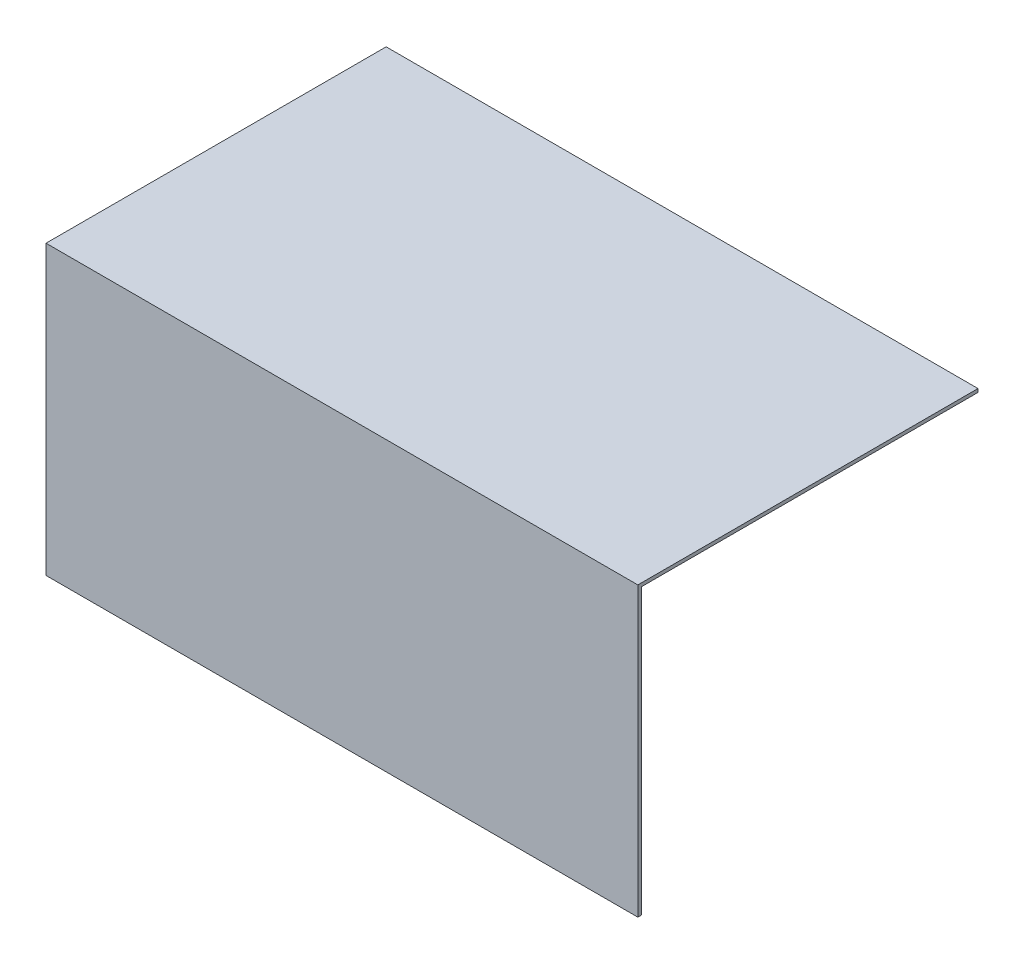
ISO-10303-21;
HEADER;
FILE_DESCRIPTION(('STEP AP214'),'2;1');
FILE_NAME('part.step','',(''),(''),'','','');
FILE_SCHEMA(('AUTOMOTIVE_DESIGN { 1 0 10303 214 1 1 1 1 }'));
ENDSEC;
DATA;
#1=APPLICATION_CONTEXT('core data for automotive mechanical design processes');
#2=APPLICATION_PROTOCOL_DEFINITION('international standard','automotive_design',2000,#1);
#3=PRODUCT_CONTEXT('',#1,'mechanical');
#4=PRODUCT('Part','Part','',(#3));
#5=PRODUCT_RELATED_PRODUCT_CATEGORY('part','',(#4));
#6=PRODUCT_DEFINITION_FORMATION('','',#4);
#7=PRODUCT_DEFINITION_CONTEXT('part definition',#1,'design');
#8=PRODUCT_DEFINITION('design','',#6,#7);
#9=PRODUCT_DEFINITION_SHAPE('','',#8);
#10=(LENGTH_UNIT() NAMED_UNIT(*) SI_UNIT(.MILLI.,.METRE.));
#11=(NAMED_UNIT(*) PLANE_ANGLE_UNIT() SI_UNIT($,.RADIAN.));
#12=(NAMED_UNIT(*) SI_UNIT($,.STERADIAN.) SOLID_ANGLE_UNIT());
#13=UNCERTAINTY_MEASURE_WITH_UNIT(LENGTH_MEASURE(1.E-05),#10,'distance_accuracy_value','');
#14=(GEOMETRIC_REPRESENTATION_CONTEXT(3) GLOBAL_UNCERTAINTY_ASSIGNED_CONTEXT((#13)) GLOBAL_UNIT_ASSIGNED_CONTEXT((#10,
#11,#12)) REPRESENTATION_CONTEXT('',''));
#15=CARTESIAN_POINT('',(0.,0.,0.));
#16=DIRECTION('',(0.,0.,1.));
#17=DIRECTION('',(1.,0.,0.));
#18=AXIS2_PLACEMENT_3D('',#15,#16,#17);
#19=CARTESIAN_POINT('',(17.5094624112729,24.0269010115407,1.));
#20=DIRECTION('',(0.,-1.,0.));
#21=DIRECTION('',(0.,0.,-1.));
#22=AXIS2_PLACEMENT_3D('',#19,#20,#21);
#23=PLANE('',#22);
#24=DIRECTION('',(-1.,0.,0.));
#25=VECTOR('',#24,1.);
#26=CARTESIAN_POINT('',(17.5094624112729,24.0269010115407,1.));
#27=LINE('',#26,#25);
#28=CARTESIAN_POINT('',(133.509462411273,24.0269010115407,1.));
#29=VERTEX_POINT('',#28);
#30=CARTESIAN_POINT('',(-40.4905375887271,24.0269010115407,1.));
#31=VERTEX_POINT('',#30);
#32=EDGE_CURVE('E79',#29,#31,#27,.T.);
#33=ORIENTED_EDGE('',*,*,#32,.F.);
#34=DIRECTION('',(0.,0.,1.));
#35=VECTOR('',#34,1.);
#36=CARTESIAN_POINT('',(133.509462411273,24.0269010115407,1.));
#37=LINE('',#36,#35);
#38=CARTESIAN_POINT('',(133.509462411273,24.0269010115407,-99.));
#39=VERTEX_POINT('',#38);
#40=EDGE_CURVE('E83',#39,#29,#37,.T.);
#41=ORIENTED_EDGE('',*,*,#40,.F.);
#42=DIRECTION('',(1.,0.,0.));
#43=VECTOR('',#42,1.);
#44=CARTESIAN_POINT('',(17.5094624112729,24.0269010115407,-99.));
#45=LINE('',#44,#43);
#46=CARTESIAN_POINT('',(-40.4905375887271,24.0269010115407,-99.));
#47=VERTEX_POINT('',#46);
#48=EDGE_CURVE('E116',#47,#39,#45,.T.);
#49=ORIENTED_EDGE('',*,*,#48,.F.);
#50=DIRECTION('',(0.,0.,-1.));
#51=VECTOR('',#50,1.);
#52=CARTESIAN_POINT('',(-40.4905375887271,24.0269010115407,1.));
#53=LINE('',#52,#51);
#54=EDGE_CURVE('E11',#31,#47,#53,.T.);
#55=ORIENTED_EDGE('',*,*,#54,.F.);
#56=EDGE_LOOP('',(#33,#41,#49,#55));
#57=FACE_BOUND('',#56,.T.);
#58=ADVANCED_FACE('F33',(#57),#23,.F.);
#59=CARTESIAN_POINT('',(-40.4905375887271,24.0269010115407,1.));
#60=DIRECTION('',(1.,0.,0.));
#61=DIRECTION('',(0.,1.,0.));
#62=AXIS2_PLACEMENT_3D('',#59,#60,#61);
#63=PLANE('',#62);
#64=ORIENTED_EDGE('',*,*,#54,.T.);
#65=DIRECTION('',(0.,1.,0.));
#66=VECTOR('',#65,1.);
#67=CARTESIAN_POINT('',(-40.4905375887271,24.0269010115407,-99.));
#68=LINE('',#67,#66);
#69=CARTESIAN_POINT('',(-40.4905375887271,23.0269010115407,-99.));
#70=VERTEX_POINT('',#69);
#71=EDGE_CURVE('E113',#70,#47,#68,.T.);
#72=ORIENTED_EDGE('',*,*,#71,.F.);
#73=DIRECTION('',(0.,0.,1.));
#74=VECTOR('',#73,1.);
#75=CARTESIAN_POINT('',(-40.4905375887271,23.0269010115407,-99.));
#76=LINE('',#75,#74);
#77=CARTESIAN_POINT('',(-40.4905375887271,23.0269010115407,0.));
#78=VERTEX_POINT('',#77);
#79=EDGE_CURVE('E118',#70,#78,#76,.T.);
#80=ORIENTED_EDGE('',*,*,#79,.T.);
#81=DIRECTION('',(0.,-1.,0.));
#82=VECTOR('',#81,1.);
#83=CARTESIAN_POINT('',(-40.4905375887271,24.0269010115407,0.));
#84=LINE('',#83,#82);
#85=CARTESIAN_POINT('',(-40.4905375887271,-60.5730989884593,0.));
#86=VERTEX_POINT('',#85);
#87=EDGE_CURVE('E122',#78,#86,#84,.T.);
#88=ORIENTED_EDGE('',*,*,#87,.T.);
#89=DIRECTION('',(0.,0.,-1.));
#90=VECTOR('',#89,1.);
#91=CARTESIAN_POINT('',(-40.4905375887271,-60.5730989884593,1.));
#92=LINE('',#91,#90);
#93=CARTESIAN_POINT('',(-40.4905375887271,-60.5730989884593,1.));
#94=VERTEX_POINT('',#93);
#95=EDGE_CURVE('E41',#94,#86,#92,.T.);
#96=ORIENTED_EDGE('',*,*,#95,.F.);
#97=DIRECTION('',(0.,-1.,0.));
#98=VECTOR('',#97,1.);
#99=CARTESIAN_POINT('',(-40.4905375887271,24.0269010115407,1.));
#100=LINE('',#99,#98);
#101=EDGE_CURVE('E48',#31,#94,#100,.T.);
#102=ORIENTED_EDGE('',*,*,#101,.F.);
#103=EDGE_LOOP('',(#64,#72,#80,#88,#96,#102));
#104=FACE_BOUND('',#103,.T.);
#105=ADVANCED_FACE('F143',(#104),#63,.F.);
#106=CARTESIAN_POINT('',(17.5094624112729,-60.5730989884593,1.));
#107=DIRECTION('',(0.,1.,0.));
#108=DIRECTION('',(-1.,0.,0.));
#109=AXIS2_PLACEMENT_3D('',#106,#107,#108);
#110=PLANE('',#109);
#111=DIRECTION('',(1.,0.,0.));
#112=VECTOR('',#111,1.);
#113=CARTESIAN_POINT('',(17.5094624112729,-60.5730989884593,0.));
#114=LINE('',#113,#112);
#115=CARTESIAN_POINT('',(133.509462411273,-60.5730989884593,0.));
#116=VERTEX_POINT('',#115);
#117=EDGE_CURVE('E84',#86,#116,#114,.T.);
#118=ORIENTED_EDGE('',*,*,#117,.T.);
#119=DIRECTION('',(0.,0.,-1.));
#120=VECTOR('',#119,1.);
#121=CARTESIAN_POINT('',(133.509462411273,-60.5730989884593,0.));
#122=LINE('',#121,#120);
#123=CARTESIAN_POINT('',(133.509462411273,-60.5730989884593,1.));
#124=VERTEX_POINT('',#123);
#125=EDGE_CURVE('E94',#124,#116,#122,.T.);
#126=ORIENTED_EDGE('',*,*,#125,.F.);
#127=DIRECTION('',(1.,0.,0.));
#128=VECTOR('',#127,1.);
#129=CARTESIAN_POINT('',(17.5094624112729,-60.5730989884593,1.));
#130=LINE('',#129,#128);
#131=EDGE_CURVE('E90',#94,#124,#130,.T.);
#132=ORIENTED_EDGE('',*,*,#131,.F.);
#133=ORIENTED_EDGE('',*,*,#95,.T.);
#134=EDGE_LOOP('',(#118,#126,#132,#133));
#135=FACE_BOUND('',#134,.T.);
#136=ADVANCED_FACE('F131',(#135),#110,.F.);
#137=CARTESIAN_POINT('',(0.,0.,1.));
#138=DIRECTION('',(0.,0.,-1.));
#139=DIRECTION('',(-1.,0.,0.));
#140=AXIS2_PLACEMENT_3D('',#137,#138,#139);
#141=PLANE('',#140);
#142=ORIENTED_EDGE('',*,*,#131,.T.);
#143=DIRECTION('',(0.,-1.,0.));
#144=VECTOR('',#143,1.);
#145=CARTESIAN_POINT('',(133.509462411273,-60.5730989884593,1.));
#146=LINE('',#145,#144);
#147=EDGE_CURVE('E87',#29,#124,#146,.T.);
#148=ORIENTED_EDGE('',*,*,#147,.F.);
#149=ORIENTED_EDGE('',*,*,#32,.T.);
#150=ORIENTED_EDGE('',*,*,#101,.T.);
#151=EDGE_LOOP('',(#142,#148,#149,#150));
#152=FACE_BOUND('',#151,.T.);
#153=ADVANCED_FACE('F88',(#152),#141,.F.);
#154=CARTESIAN_POINT('',(0.,0.,0.));
#155=DIRECTION('',(0.,0.,-1.));
#156=DIRECTION('',(-1.,0.,0.));
#157=AXIS2_PLACEMENT_3D('',#154,#155,#156);
#158=PLANE('',#157);
#159=DIRECTION('',(-1.,0.,0.));
#160=VECTOR('',#159,1.);
#161=CARTESIAN_POINT('',(17.5094624112729,23.0269010115407,0.));
#162=LINE('',#161,#160);
#163=CARTESIAN_POINT('',(133.509462411273,23.0269010115407,0.));
#164=VERTEX_POINT('',#163);
#165=EDGE_CURVE('E110',#164,#78,#162,.T.);
#166=ORIENTED_EDGE('',*,*,#165,.F.);
#167=DIRECTION('',(0.,1.,0.));
#168=VECTOR('',#167,1.);
#169=CARTESIAN_POINT('',(133.509462411273,23.0269010115407,0.));
#170=LINE('',#169,#168);
#171=EDGE_CURVE('E104',#116,#164,#170,.T.);
#172=ORIENTED_EDGE('',*,*,#171,.F.);
#173=ORIENTED_EDGE('',*,*,#117,.F.);
#174=ORIENTED_EDGE('',*,*,#87,.F.);
#175=EDGE_LOOP('',(#166,#172,#173,#174));
#176=FACE_BOUND('',#175,.T.);
#177=ADVANCED_FACE('F135',(#176),#158,.T.);
#178=CARTESIAN_POINT('',(17.5094624112729,23.0269010115407,-99.));
#179=DIRECTION('',(0.,1.,0.));
#180=DIRECTION('',(0.,0.,1.));
#181=AXIS2_PLACEMENT_3D('',#178,#179,#180);
#182=PLANE('',#181);
#183=ORIENTED_EDGE('',*,*,#165,.T.);
#184=ORIENTED_EDGE('',*,*,#79,.F.);
#185=DIRECTION('',(-1.,0.,0.));
#186=VECTOR('',#185,1.);
#187=CARTESIAN_POINT('',(17.5094624112729,23.0269010115407,-99.));
#188=LINE('',#187,#186);
#189=CARTESIAN_POINT('',(133.509462411273,23.0269010115407,-99.));
#190=VERTEX_POINT('',#189);
#191=EDGE_CURVE('E111',#190,#70,#188,.T.);
#192=ORIENTED_EDGE('',*,*,#191,.F.);
#193=DIRECTION('',(0.,0.,-1.));
#194=VECTOR('',#193,1.);
#195=CARTESIAN_POINT('',(133.509462411273,23.0269010115407,-99.));
#196=LINE('',#195,#194);
#197=EDGE_CURVE('E107',#164,#190,#196,.T.);
#198=ORIENTED_EDGE('',*,*,#197,.F.);
#199=EDGE_LOOP('',(#183,#184,#192,#198));
#200=FACE_BOUND('',#199,.T.);
#201=ADVANCED_FACE('F138',(#200),#182,.F.);
#202=CARTESIAN_POINT('',(0.,0.,-99.));
#203=DIRECTION('',(0.,0.,-1.));
#204=DIRECTION('',(-1.,0.,0.));
#205=AXIS2_PLACEMENT_3D('',#202,#203,#204);
#206=PLANE('',#205);
#207=ORIENTED_EDGE('',*,*,#48,.T.);
#208=DIRECTION('',(0.,1.,0.));
#209=VECTOR('',#208,1.);
#210=CARTESIAN_POINT('',(133.509462411273,24.0269010115407,-99.));
#211=LINE('',#210,#209);
#212=EDGE_CURVE('E100',#190,#39,#211,.T.);
#213=ORIENTED_EDGE('',*,*,#212,.F.);
#214=ORIENTED_EDGE('',*,*,#191,.T.);
#215=ORIENTED_EDGE('',*,*,#71,.T.);
#216=EDGE_LOOP('',(#207,#213,#214,#215));
#217=FACE_BOUND('',#216,.T.);
#218=ADVANCED_FACE('F142',(#217),#206,.T.);
#219=CARTESIAN_POINT('',(133.509462411273,0.,0.));
#220=DIRECTION('',(-1.,0.,0.));
#221=DIRECTION('',(0.,0.,1.));
#222=AXIS2_PLACEMENT_3D('',#219,#220,#221);
#223=PLANE('',#222);
#224=ORIENTED_EDGE('',*,*,#40,.T.);
#225=ORIENTED_EDGE('',*,*,#147,.T.);
#226=ORIENTED_EDGE('',*,*,#125,.T.);
#227=ORIENTED_EDGE('',*,*,#171,.T.);
#228=ORIENTED_EDGE('',*,*,#197,.T.);
#229=ORIENTED_EDGE('',*,*,#212,.T.);
#230=EDGE_LOOP('',(#224,#225,#226,#227,#228,#229));
#231=FACE_BOUND('',#230,.T.);
#232=ADVANCED_FACE('F97',(#231),#223,.F.);
#233=CLOSED_SHELL('',(#58,#105,#136,#153,#177,#201,#218,#232));
#234=MANIFOLD_SOLID_BREP('B2',#233);
#235=ADVANCED_BREP_SHAPE_REPRESENTATION('',(#18,#234),#14);
#236=SHAPE_DEFINITION_REPRESENTATION(#9,#235);
ENDSEC;
END-ISO-10303-21;
